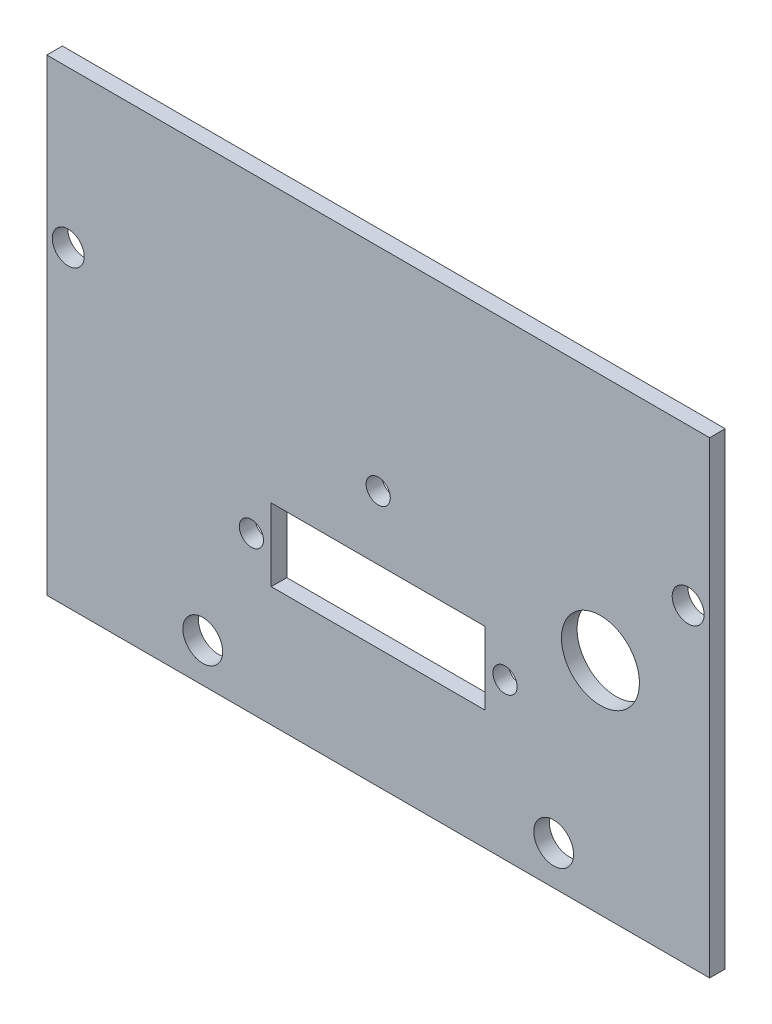
ISO-10303-21;
HEADER;
FILE_DESCRIPTION(('STEP AP214'),'2;1');
FILE_NAME('part.step','',(''),(''),'','','');
FILE_SCHEMA(('AUTOMOTIVE_DESIGN { 1 0 10303 214 1 1 1 1 }'));
ENDSEC;
DATA;
#1=APPLICATION_CONTEXT('core data for automotive mechanical design processes');
#2=APPLICATION_PROTOCOL_DEFINITION('international standard','automotive_design',2000,#1);
#3=PRODUCT_CONTEXT('',#1,'mechanical');
#4=PRODUCT('Part','Part','',(#3));
#5=PRODUCT_RELATED_PRODUCT_CATEGORY('part','',(#4));
#6=PRODUCT_DEFINITION_FORMATION('','',#4);
#7=PRODUCT_DEFINITION_CONTEXT('part definition',#1,'design');
#8=PRODUCT_DEFINITION('design','',#6,#7);
#9=PRODUCT_DEFINITION_SHAPE('','',#8);
#10=(LENGTH_UNIT() NAMED_UNIT(*) SI_UNIT(.MILLI.,.METRE.));
#11=(NAMED_UNIT(*) PLANE_ANGLE_UNIT() SI_UNIT($,.RADIAN.));
#12=(NAMED_UNIT(*) SI_UNIT($,.STERADIAN.) SOLID_ANGLE_UNIT());
#13=UNCERTAINTY_MEASURE_WITH_UNIT(LENGTH_MEASURE(1.E-05),#10,'distance_accuracy_value','');
#14=(GEOMETRIC_REPRESENTATION_CONTEXT(3) GLOBAL_UNCERTAINTY_ASSIGNED_CONTEXT((#13)) GLOBAL_UNIT_ASSIGNED_CONTEXT((#10,
#11,#12)) REPRESENTATION_CONTEXT('',''));
#15=CARTESIAN_POINT('',(0.,0.,0.));
#16=DIRECTION('',(0.,0.,1.));
#17=DIRECTION('',(1.,0.,0.));
#18=AXIS2_PLACEMENT_3D('',#15,#16,#17);
#19=CARTESIAN_POINT('',(-57.6928494941217,22.4995662721312,2.));
#20=DIRECTION('',(1.,0.,0.));
#21=DIRECTION('',(0.,1.,0.));
#22=AXIS2_PLACEMENT_3D('',#19,#20,#21);
#23=PLANE('',#22);
#24=DIRECTION('',(0.,-1.,0.));
#25=VECTOR('',#24,1.);
#26=CARTESIAN_POINT('',(-57.6928494941217,22.4995662721312,0.));
#27=LINE('',#26,#25);
#28=CARTESIAN_POINT('',(-57.6928494941217,22.4995662721312,0.));
#29=VERTEX_POINT('',#28);
#30=CARTESIAN_POINT('',(-57.6928494941217,-37.5004337278688,0.));
#31=VERTEX_POINT('',#30);
#32=EDGE_CURVE('E165',#29,#31,#27,.T.);
#33=ORIENTED_EDGE('',*,*,#32,.T.);
#34=DIRECTION('',(0.,0.,-1.));
#35=VECTOR('',#34,1.);
#36=CARTESIAN_POINT('',(-57.6928494941217,-37.5004337278688,2.));
#37=LINE('',#36,#35);
#38=CARTESIAN_POINT('',(-57.6928494941217,-37.5004337278688,2.));
#39=VERTEX_POINT('',#38);
#40=EDGE_CURVE('E11',#39,#31,#37,.T.);
#41=ORIENTED_EDGE('',*,*,#40,.F.);
#42=DIRECTION('',(0.,-1.,0.));
#43=VECTOR('',#42,1.);
#44=CARTESIAN_POINT('',(-57.6928494941217,22.4995662721312,2.));
#45=LINE('',#44,#43);
#46=CARTESIAN_POINT('',(-57.6928494941217,22.4995662721312,2.));
#47=VERTEX_POINT('',#46);
#48=EDGE_CURVE('E168',#47,#39,#45,.T.);
#49=ORIENTED_EDGE('',*,*,#48,.F.);
#50=DIRECTION('',(0.,0.,-1.));
#51=VECTOR('',#50,1.);
#52=CARTESIAN_POINT('',(-57.6928494941217,22.4995662721312,2.));
#53=LINE('',#52,#51);
#54=EDGE_CURVE('E178',#47,#29,#53,.T.);
#55=ORIENTED_EDGE('',*,*,#54,.T.);
#56=EDGE_LOOP('',(#33,#41,#49,#55));
#57=FACE_BOUND('',#56,.T.);
#58=ADVANCED_FACE('F33',(#57),#23,.F.);
#59=CARTESIAN_POINT('',(-57.6928494941217,-37.5004337278688,2.));
#60=DIRECTION('',(0.,1.,0.));
#61=DIRECTION('',(0.,0.,1.));
#62=AXIS2_PLACEMENT_3D('',#59,#60,#61);
#63=PLANE('',#62);
#64=DIRECTION('',(1.,0.,0.));
#65=VECTOR('',#64,1.);
#66=CARTESIAN_POINT('',(-57.6928494941217,-37.5004337278688,0.));
#67=LINE('',#66,#65);
#68=CARTESIAN_POINT('',(27.3071505058783,-37.5004337278688,0.));
#69=VERTEX_POINT('',#68);
#70=EDGE_CURVE('E181',#31,#69,#67,.T.);
#71=ORIENTED_EDGE('',*,*,#70,.T.);
#72=DIRECTION('',(0.,0.,-1.));
#73=VECTOR('',#72,1.);
#74=CARTESIAN_POINT('',(27.3071505058783,-37.5004337278688,2.));
#75=LINE('',#74,#73);
#76=CARTESIAN_POINT('',(27.3071505058783,-37.5004337278688,2.));
#77=VERTEX_POINT('',#76);
#78=EDGE_CURVE('E40',#77,#69,#75,.T.);
#79=ORIENTED_EDGE('',*,*,#78,.F.);
#80=DIRECTION('',(1.,0.,0.));
#81=VECTOR('',#80,1.);
#82=CARTESIAN_POINT('',(-57.6928494941217,-37.5004337278688,2.));
#83=LINE('',#82,#81);
#84=EDGE_CURVE('E171',#39,#77,#83,.T.);
#85=ORIENTED_EDGE('',*,*,#84,.F.);
#86=ORIENTED_EDGE('',*,*,#40,.T.);
#87=EDGE_LOOP('',(#71,#79,#85,#86));
#88=FACE_BOUND('',#87,.T.);
#89=ADVANCED_FACE('F210',(#88),#63,.F.);
#90=CARTESIAN_POINT('',(27.3071505058783,22.4995662721312,2.));
#91=DIRECTION('',(-1.,0.,0.));
#92=DIRECTION('',(0.,-1.,0.));
#93=AXIS2_PLACEMENT_3D('',#90,#91,#92);
#94=PLANE('',#93);
#95=DIRECTION('',(0.,1.,0.));
#96=VECTOR('',#95,1.);
#97=CARTESIAN_POINT('',(27.3071505058783,22.4995662721312,0.));
#98=LINE('',#97,#96);
#99=CARTESIAN_POINT('',(27.3071505058783,22.4995662721312,0.));
#100=VERTEX_POINT('',#99);
#101=EDGE_CURVE('E183',#69,#100,#98,.T.);
#102=ORIENTED_EDGE('',*,*,#101,.T.);
#103=DIRECTION('',(0.,0.,-1.));
#104=VECTOR('',#103,1.);
#105=CARTESIAN_POINT('',(27.3071505058783,22.4995662721312,2.));
#106=LINE('',#105,#104);
#107=CARTESIAN_POINT('',(27.3071505058783,22.4995662721312,2.));
#108=VERTEX_POINT('',#107);
#109=EDGE_CURVE('E188',#108,#100,#106,.T.);
#110=ORIENTED_EDGE('',*,*,#109,.F.);
#111=DIRECTION('',(0.,1.,0.));
#112=VECTOR('',#111,1.);
#113=CARTESIAN_POINT('',(27.3071505058783,22.4995662721312,2.));
#114=LINE('',#113,#112);
#115=EDGE_CURVE('E174',#77,#108,#114,.T.);
#116=ORIENTED_EDGE('',*,*,#115,.F.);
#117=ORIENTED_EDGE('',*,*,#78,.T.);
#118=EDGE_LOOP('',(#102,#110,#116,#117));
#119=FACE_BOUND('',#118,.T.);
#120=ADVANCED_FACE('F195',(#119),#94,.F.);
#121=CARTESIAN_POINT('',(-57.6928494941217,22.4995662721312,2.));
#122=DIRECTION('',(0.,-1.,0.));
#123=DIRECTION('',(0.,0.,-1.));
#124=AXIS2_PLACEMENT_3D('',#121,#122,#123);
#125=PLANE('',#124);
#126=DIRECTION('',(-1.,0.,0.));
#127=VECTOR('',#126,1.);
#128=CARTESIAN_POINT('',(-57.6928494941217,22.4995662721312,0.));
#129=LINE('',#128,#127);
#130=EDGE_CURVE('E172',#100,#29,#129,.T.);
#131=ORIENTED_EDGE('',*,*,#130,.T.);
#132=ORIENTED_EDGE('',*,*,#54,.F.);
#133=DIRECTION('',(-1.,0.,0.));
#134=VECTOR('',#133,1.);
#135=CARTESIAN_POINT('',(-57.6928494941217,22.4995662721312,2.));
#136=LINE('',#135,#134);
#137=EDGE_CURVE('E176',#108,#47,#136,.T.);
#138=ORIENTED_EDGE('',*,*,#137,.F.);
#139=ORIENTED_EDGE('',*,*,#109,.T.);
#140=EDGE_LOOP('',(#131,#132,#138,#139));
#141=FACE_BOUND('',#140,.T.);
#142=ADVANCED_FACE('F204',(#141),#125,.F.);
#143=CARTESIAN_POINT('',(0.,0.,2.));
#144=DIRECTION('',(0.,0.,1.));
#145=DIRECTION('',(1.,0.,0.));
#146=AXIS2_PLACEMENT_3D('',#143,#144,#145);
#147=PLANE('',#146);
#148=CARTESIAN_POINT('',(24.5571505058783,2.49956627213123,2.));
#149=DIRECTION('',(0.,0.,1.));
#150=DIRECTION('',(1.,0.,0.));
#151=AXIS2_PLACEMENT_3D('',#148,#149,#150);
#152=CIRCLE('',#151,2.05);
#153=CARTESIAN_POINT('',(26.6071505058783,2.49956627213123,2.));
#154=VERTEX_POINT('',#153);
#155=EDGE_CURVE('E274',#154,#154,#152,.T.);
#156=ORIENTED_EDGE('',*,*,#155,.F.);
#157=EDGE_LOOP('',(#156));
#158=FACE_BOUND('',#157,.T.);
#159=CARTESIAN_POINT('',(-54.9428494941217,2.49956627213123,2.));
#160=DIRECTION('',(0.,0.,1.));
#161=DIRECTION('',(1.,0.,0.));
#162=AXIS2_PLACEMENT_3D('',#159,#160,#161);
#163=CIRCLE('',#162,2.05);
#164=CARTESIAN_POINT('',(-52.8928494941217,2.49956627213123,2.));
#165=VERTEX_POINT('',#164);
#166=EDGE_CURVE('E278',#165,#165,#163,.T.);
#167=ORIENTED_EDGE('',*,*,#166,.F.);
#168=EDGE_LOOP('',(#167));
#169=FACE_BOUND('',#168,.T.);
#170=DIRECTION('',(0.,-1.,0.));
#171=VECTOR('',#170,1.);
#172=CARTESIAN_POINT('',(-1.47284949412169,-12.8504337278688,2.));
#173=LINE('',#172,#171);
#174=CARTESIAN_POINT('',(-1.47284949412169,-12.8504337278688,2.));
#175=VERTEX_POINT('',#174);
#176=CARTESIAN_POINT('',(-1.47284949412169,-22.1504337278688,2.));
#177=VERTEX_POINT('',#176);
#178=EDGE_CURVE('E107',#175,#177,#173,.T.);
#179=ORIENTED_EDGE('',*,*,#178,.T.);
#180=DIRECTION('',(-1.,0.,0.));
#181=VECTOR('',#180,1.);
#182=CARTESIAN_POINT('',(-1.47284949412169,-22.1504337278688,2.));
#183=LINE('',#182,#181);
#184=CARTESIAN_POINT('',(-28.9128494941217,-22.1504337278688,2.));
#185=VERTEX_POINT('',#184);
#186=EDGE_CURVE('E96',#177,#185,#183,.T.);
#187=ORIENTED_EDGE('',*,*,#186,.T.);
#188=DIRECTION('',(0.,1.,0.));
#189=VECTOR('',#188,1.);
#190=CARTESIAN_POINT('',(-28.9128494941217,-12.8504337278688,2.));
#191=LINE('',#190,#189);
#192=CARTESIAN_POINT('',(-28.9128494941217,-12.8504337278688,2.));
#193=VERTEX_POINT('',#192);
#194=EDGE_CURVE('E118',#185,#193,#191,.T.);
#195=ORIENTED_EDGE('',*,*,#194,.T.);
#196=DIRECTION('',(1.,0.,0.));
#197=VECTOR('',#196,1.);
#198=CARTESIAN_POINT('',(-1.47284949412169,-12.8504337278688,2.));
#199=LINE('',#198,#197);
#200=EDGE_CURVE('E114',#193,#175,#199,.T.);
#201=ORIENTED_EDGE('',*,*,#200,.T.);
#202=EDGE_LOOP('',(#179,#187,#195,#201));
#203=FACE_BOUND('',#202,.T.);
#204=CARTESIAN_POINT('',(-31.4528494941217,-17.5004337278688,2.));
#205=DIRECTION('',(0.,0.,1.));
#206=DIRECTION('',(1.,0.,0.));
#207=AXIS2_PLACEMENT_3D('',#204,#205,#206);
#208=CIRCLE('',#207,1.55);
#209=CARTESIAN_POINT('',(-29.9028494941217,-17.5004337278688,2.));
#210=VERTEX_POINT('',#209);
#211=EDGE_CURVE('E103',#210,#210,#208,.F.);
#212=ORIENTED_EDGE('',*,*,#211,.T.);
#213=EDGE_LOOP('',(#212));
#214=FACE_BOUND('',#213,.T.);
#215=CARTESIAN_POINT('',(1.06715050587831,-17.5004337278688,2.));
#216=DIRECTION('',(0.,0.,1.));
#217=DIRECTION('',(1.,0.,0.));
#218=AXIS2_PLACEMENT_3D('',#215,#216,#217);
#219=CIRCLE('',#218,1.55);
#220=CARTESIAN_POINT('',(2.61715050587831,-17.5004337278688,2.));
#221=VERTEX_POINT('',#220);
#222=EDGE_CURVE('E135',#221,#221,#219,.F.);
#223=ORIENTED_EDGE('',*,*,#222,.T.);
#224=EDGE_LOOP('',(#223));
#225=FACE_BOUND('',#224,.T.);
#226=CARTESIAN_POINT('',(-15.1928494941217,-4.67043372786877,2.));
#227=DIRECTION('',(0.,0.,1.));
#228=DIRECTION('',(1.,0.,0.));
#229=AXIS2_PLACEMENT_3D('',#226,#227,#228);
#230=CIRCLE('',#229,1.55);
#231=CARTESIAN_POINT('',(-13.6428494941217,-4.67043372786877,2.));
#232=VERTEX_POINT('',#231);
#233=EDGE_CURVE('E141',#232,#232,#230,.F.);
#234=ORIENTED_EDGE('',*,*,#233,.T.);
#235=EDGE_LOOP('',(#234));
#236=FACE_BOUND('',#235,.T.);
#237=CARTESIAN_POINT('',(13.3071505058783,-9.24043372786876,2.));
#238=DIRECTION('',(0.,0.,1.));
#239=DIRECTION('',(1.,0.,0.));
#240=AXIS2_PLACEMENT_3D('',#237,#238,#239);
#241=CIRCLE('',#240,5.);
#242=CARTESIAN_POINT('',(18.3071505058783,-9.24043372786876,2.));
#243=VERTEX_POINT('',#242);
#244=EDGE_CURVE('E147',#243,#243,#241,.F.);
#245=ORIENTED_EDGE('',*,*,#244,.T.);
#246=EDGE_LOOP('',(#245));
#247=FACE_BOUND('',#246,.T.);
#248=CARTESIAN_POINT('',(-37.6928494941217,-32.5004337278688,2.));
#249=DIRECTION('',(0.,0.,1.));
#250=DIRECTION('',(1.,0.,0.));
#251=AXIS2_PLACEMENT_3D('',#248,#249,#250);
#252=CIRCLE('',#251,2.55);
#253=CARTESIAN_POINT('',(-35.1428494941217,-32.5004337278688,2.));
#254=VERTEX_POINT('',#253);
#255=EDGE_CURVE('E153',#254,#254,#252,.F.);
#256=ORIENTED_EDGE('',*,*,#255,.T.);
#257=EDGE_LOOP('',(#256));
#258=FACE_BOUND('',#257,.T.);
#259=CARTESIAN_POINT('',(7.30715050587833,-32.5004337278688,2.));
#260=DIRECTION('',(0.,0.,1.));
#261=DIRECTION('',(1.,0.,0.));
#262=AXIS2_PLACEMENT_3D('',#259,#260,#261);
#263=CIRCLE('',#262,2.55);
#264=CARTESIAN_POINT('',(9.85715050587833,-32.5004337278688,2.));
#265=VERTEX_POINT('',#264);
#266=EDGE_CURVE('E159',#265,#265,#263,.F.);
#267=ORIENTED_EDGE('',*,*,#266,.T.);
#268=EDGE_LOOP('',(#267));
#269=FACE_BOUND('',#268,.T.);
#270=ORIENTED_EDGE('',*,*,#48,.T.);
#271=ORIENTED_EDGE('',*,*,#84,.T.);
#272=ORIENTED_EDGE('',*,*,#115,.T.);
#273=ORIENTED_EDGE('',*,*,#137,.T.);
#274=EDGE_LOOP('',(#270,#271,#272,#273));
#275=FACE_BOUND('',#274,.T.);
#276=ADVANCED_FACE('F112',(#158,#169,#203,#214,#225,#236,#247,#258,#269,#275),#147,.T.);
#277=CARTESIAN_POINT('',(0.,0.,0.));
#278=DIRECTION('',(0.,0.,1.));
#279=DIRECTION('',(1.,0.,0.));
#280=AXIS2_PLACEMENT_3D('',#277,#278,#279);
#281=PLANE('',#280);
#282=CARTESIAN_POINT('',(24.5571505058783,2.49956627213123,0.));
#283=DIRECTION('',(0.,0.,1.));
#284=DIRECTION('',(1.,0.,0.));
#285=AXIS2_PLACEMENT_3D('',#282,#283,#284);
#286=CIRCLE('',#285,2.05);
#287=CARTESIAN_POINT('',(26.6071505058783,2.49956627213123,0.));
#288=VERTEX_POINT('',#287);
#289=EDGE_CURVE('E277',#288,#288,#286,.F.);
#290=ORIENTED_EDGE('',*,*,#289,.F.);
#291=EDGE_LOOP('',(#290));
#292=FACE_BOUND('',#291,.T.);
#293=CARTESIAN_POINT('',(-54.9428494941217,2.49956627213123,0.));
#294=DIRECTION('',(0.,0.,1.));
#295=DIRECTION('',(1.,0.,0.));
#296=AXIS2_PLACEMENT_3D('',#293,#294,#295);
#297=CIRCLE('',#296,2.05);
#298=CARTESIAN_POINT('',(-52.8928494941217,2.49956627213123,0.));
#299=VERTEX_POINT('',#298);
#300=EDGE_CURVE('E281',#299,#299,#297,.F.);
#301=ORIENTED_EDGE('',*,*,#300,.F.);
#302=EDGE_LOOP('',(#301));
#303=FACE_BOUND('',#302,.T.);
#304=DIRECTION('',(-1.,0.,0.));
#305=VECTOR('',#304,1.);
#306=CARTESIAN_POINT('',(-1.47284949412169,-22.1504337278688,0.));
#307=LINE('',#306,#305);
#308=CARTESIAN_POINT('',(-1.47284949412169,-22.1504337278688,0.));
#309=VERTEX_POINT('',#308);
#310=CARTESIAN_POINT('',(-28.9128494941217,-22.1504337278688,0.));
#311=VERTEX_POINT('',#310);
#312=EDGE_CURVE('E116',#309,#311,#307,.T.);
#313=ORIENTED_EDGE('',*,*,#312,.F.);
#314=DIRECTION('',(0.,-1.,0.));
#315=VECTOR('',#314,1.);
#316=CARTESIAN_POINT('',(-1.47284949412169,-12.8504337278688,0.));
#317=LINE('',#316,#315);
#318=CARTESIAN_POINT('',(-1.47284949412169,-12.8504337278688,0.));
#319=VERTEX_POINT('',#318);
#320=EDGE_CURVE('E55',#319,#309,#317,.T.);
#321=ORIENTED_EDGE('',*,*,#320,.F.);
#322=DIRECTION('',(1.,0.,0.));
#323=VECTOR('',#322,1.);
#324=CARTESIAN_POINT('',(-1.47284949412169,-12.8504337278688,0.));
#325=LINE('',#324,#323);
#326=CARTESIAN_POINT('',(-28.9128494941217,-12.8504337278688,0.));
#327=VERTEX_POINT('',#326);
#328=EDGE_CURVE('E109',#327,#319,#325,.T.);
#329=ORIENTED_EDGE('',*,*,#328,.F.);
#330=DIRECTION('',(0.,1.,0.));
#331=VECTOR('',#330,1.);
#332=CARTESIAN_POINT('',(-28.9128494941217,-12.8504337278688,0.));
#333=LINE('',#332,#331);
#334=EDGE_CURVE('E123',#311,#327,#333,.T.);
#335=ORIENTED_EDGE('',*,*,#334,.F.);
#336=EDGE_LOOP('',(#313,#321,#329,#335));
#337=FACE_BOUND('',#336,.T.);
#338=CARTESIAN_POINT('',(-31.4528494941217,-17.5004337278688,0.));
#339=DIRECTION('',(0.,0.,-1.));
#340=DIRECTION('',(-1.,0.,0.));
#341=AXIS2_PLACEMENT_3D('',#338,#339,#340);
#342=CIRCLE('',#341,1.55);
#343=CARTESIAN_POINT('',(-33.0028494941217,-17.5004337278688,0.));
#344=VERTEX_POINT('',#343);
#345=EDGE_CURVE('E132',#344,#344,#342,.T.);
#346=ORIENTED_EDGE('',*,*,#345,.F.);
#347=EDGE_LOOP('',(#346));
#348=FACE_BOUND('',#347,.T.);
#349=CARTESIAN_POINT('',(1.06715050587831,-17.5004337278688,0.));
#350=DIRECTION('',(0.,0.,-1.));
#351=DIRECTION('',(-1.,0.,0.));
#352=AXIS2_PLACEMENT_3D('',#349,#350,#351);
#353=CIRCLE('',#352,1.55);
#354=CARTESIAN_POINT('',(-0.482849494121686,-17.5004337278688,0.));
#355=VERTEX_POINT('',#354);
#356=EDGE_CURVE('E138',#355,#355,#353,.T.);
#357=ORIENTED_EDGE('',*,*,#356,.F.);
#358=EDGE_LOOP('',(#357));
#359=FACE_BOUND('',#358,.T.);
#360=CARTESIAN_POINT('',(-15.1928494941217,-4.67043372786877,0.));
#361=DIRECTION('',(0.,0.,-1.));
#362=DIRECTION('',(-1.,0.,0.));
#363=AXIS2_PLACEMENT_3D('',#360,#361,#362);
#364=CIRCLE('',#363,1.55);
#365=CARTESIAN_POINT('',(-16.7428494941217,-4.67043372786877,0.));
#366=VERTEX_POINT('',#365);
#367=EDGE_CURVE('E144',#366,#366,#364,.T.);
#368=ORIENTED_EDGE('',*,*,#367,.F.);
#369=EDGE_LOOP('',(#368));
#370=FACE_BOUND('',#369,.T.);
#371=CARTESIAN_POINT('',(13.3071505058783,-9.24043372786876,0.));
#372=DIRECTION('',(0.,0.,-1.));
#373=DIRECTION('',(-1.,0.,0.));
#374=AXIS2_PLACEMENT_3D('',#371,#372,#373);
#375=CIRCLE('',#374,5.);
#376=CARTESIAN_POINT('',(8.30715050587831,-9.24043372786876,0.));
#377=VERTEX_POINT('',#376);
#378=EDGE_CURVE('E150',#377,#377,#375,.T.);
#379=ORIENTED_EDGE('',*,*,#378,.F.);
#380=EDGE_LOOP('',(#379));
#381=FACE_BOUND('',#380,.T.);
#382=CARTESIAN_POINT('',(-37.6928494941217,-32.5004337278688,0.));
#383=DIRECTION('',(0.,0.,-1.));
#384=DIRECTION('',(-1.,0.,0.));
#385=AXIS2_PLACEMENT_3D('',#382,#383,#384);
#386=CIRCLE('',#385,2.55);
#387=CARTESIAN_POINT('',(-40.2428494941217,-32.5004337278688,0.));
#388=VERTEX_POINT('',#387);
#389=EDGE_CURVE('E156',#388,#388,#386,.T.);
#390=ORIENTED_EDGE('',*,*,#389,.F.);
#391=EDGE_LOOP('',(#390));
#392=FACE_BOUND('',#391,.T.);
#393=CARTESIAN_POINT('',(7.30715050587833,-32.5004337278688,0.));
#394=DIRECTION('',(0.,0.,-1.));
#395=DIRECTION('',(-1.,0.,0.));
#396=AXIS2_PLACEMENT_3D('',#393,#394,#395);
#397=CIRCLE('',#396,2.55);
#398=CARTESIAN_POINT('',(4.75715050587833,-32.5004337278688,0.));
#399=VERTEX_POINT('',#398);
#400=EDGE_CURVE('E162',#399,#399,#397,.T.);
#401=ORIENTED_EDGE('',*,*,#400,.F.);
#402=EDGE_LOOP('',(#401));
#403=FACE_BOUND('',#402,.T.);
#404=ORIENTED_EDGE('',*,*,#32,.F.);
#405=ORIENTED_EDGE('',*,*,#130,.F.);
#406=ORIENTED_EDGE('',*,*,#101,.F.);
#407=ORIENTED_EDGE('',*,*,#70,.F.);
#408=EDGE_LOOP('',(#404,#405,#406,#407));
#409=FACE_BOUND('',#408,.T.);
#410=ADVANCED_FACE('F201',(#292,#303,#337,#348,#359,#370,#381,#392,#403,#409),#281,.F.);
#411=CARTESIAN_POINT('',(7.30715050587833,-32.5004337278688,2.001));
#412=DIRECTION('',(0.,0.,-1.));
#413=DIRECTION('',(-1.,0.,0.));
#414=AXIS2_PLACEMENT_3D('',#411,#412,#413);
#415=CYLINDRICAL_SURFACE('',#414,2.55);
#416=ORIENTED_EDGE('',*,*,#266,.F.);
#417=EDGE_LOOP('',(#416));
#418=FACE_BOUND('',#417,.T.);
#419=ORIENTED_EDGE('',*,*,#400,.T.);
#420=EDGE_LOOP('',(#419));
#421=FACE_BOUND('',#420,.T.);
#422=ADVANCED_FACE('F222',(#418,#421),#415,.F.);
#423=CARTESIAN_POINT('',(-37.6928494941217,-32.5004337278688,2.001));
#424=DIRECTION('',(0.,0.,-1.));
#425=DIRECTION('',(-1.,0.,0.));
#426=AXIS2_PLACEMENT_3D('',#423,#424,#425);
#427=CYLINDRICAL_SURFACE('',#426,2.55);
#428=ORIENTED_EDGE('',*,*,#255,.F.);
#429=EDGE_LOOP('',(#428));
#430=FACE_BOUND('',#429,.T.);
#431=ORIENTED_EDGE('',*,*,#389,.T.);
#432=EDGE_LOOP('',(#431));
#433=FACE_BOUND('',#432,.T.);
#434=ADVANCED_FACE('F229',(#430,#433),#427,.F.);
#435=CARTESIAN_POINT('',(13.3071505058783,-9.24043372786876,2.001));
#436=DIRECTION('',(0.,0.,-1.));
#437=DIRECTION('',(-1.,0.,0.));
#438=AXIS2_PLACEMENT_3D('',#435,#436,#437);
#439=CYLINDRICAL_SURFACE('',#438,5.);
#440=ORIENTED_EDGE('',*,*,#244,.F.);
#441=EDGE_LOOP('',(#440));
#442=FACE_BOUND('',#441,.T.);
#443=ORIENTED_EDGE('',*,*,#378,.T.);
#444=EDGE_LOOP('',(#443));
#445=FACE_BOUND('',#444,.T.);
#446=ADVANCED_FACE('F233',(#442,#445),#439,.F.);
#447=CARTESIAN_POINT('',(-15.1928494941217,-4.67043372786877,2.001));
#448=DIRECTION('',(0.,0.,-1.));
#449=DIRECTION('',(-1.,0.,0.));
#450=AXIS2_PLACEMENT_3D('',#447,#448,#449);
#451=CYLINDRICAL_SURFACE('',#450,1.55);
#452=ORIENTED_EDGE('',*,*,#233,.F.);
#453=EDGE_LOOP('',(#452));
#454=FACE_BOUND('',#453,.T.);
#455=ORIENTED_EDGE('',*,*,#367,.T.);
#456=EDGE_LOOP('',(#455));
#457=FACE_BOUND('',#456,.T.);
#458=ADVANCED_FACE('F237',(#454,#457),#451,.F.);
#459=CARTESIAN_POINT('',(1.06715050587831,-17.5004337278688,2.001));
#460=DIRECTION('',(0.,0.,-1.));
#461=DIRECTION('',(-1.,0.,0.));
#462=AXIS2_PLACEMENT_3D('',#459,#460,#461);
#463=CYLINDRICAL_SURFACE('',#462,1.55);
#464=ORIENTED_EDGE('',*,*,#222,.F.);
#465=EDGE_LOOP('',(#464));
#466=FACE_BOUND('',#465,.T.);
#467=ORIENTED_EDGE('',*,*,#356,.T.);
#468=EDGE_LOOP('',(#467));
#469=FACE_BOUND('',#468,.T.);
#470=ADVANCED_FACE('F241',(#466,#469),#463,.F.);
#471=CARTESIAN_POINT('',(-31.4528494941217,-17.5004337278688,2.001));
#472=DIRECTION('',(0.,0.,-1.));
#473=DIRECTION('',(-1.,0.,0.));
#474=AXIS2_PLACEMENT_3D('',#471,#472,#473);
#475=CYLINDRICAL_SURFACE('',#474,1.55);
#476=ORIENTED_EDGE('',*,*,#211,.F.);
#477=EDGE_LOOP('',(#476));
#478=FACE_BOUND('',#477,.T.);
#479=ORIENTED_EDGE('',*,*,#345,.T.);
#480=EDGE_LOOP('',(#479));
#481=FACE_BOUND('',#480,.T.);
#482=ADVANCED_FACE('F245',(#478,#481),#475,.F.);
#483=CARTESIAN_POINT('',(-1.47284949412169,-12.8504337278688,2.001));
#484=DIRECTION('',(1.,0.,0.));
#485=DIRECTION('',(0.,1.,0.));
#486=AXIS2_PLACEMENT_3D('',#483,#484,#485);
#487=PLANE('',#486);
#488=DIRECTION('',(0.,0.,-1.));
#489=VECTOR('',#488,1.);
#490=CARTESIAN_POINT('',(-1.47284949412169,-12.8504337278688,2.001));
#491=LINE('',#490,#489);
#492=EDGE_CURVE('E104',#175,#319,#491,.T.);
#493=ORIENTED_EDGE('',*,*,#492,.T.);
#494=ORIENTED_EDGE('',*,*,#320,.T.);
#495=DIRECTION('',(0.,0.,-1.));
#496=VECTOR('',#495,1.);
#497=CARTESIAN_POINT('',(-1.47284949412169,-22.1504337278688,2.001));
#498=LINE('',#497,#496);
#499=EDGE_CURVE('E98',#177,#309,#498,.T.);
#500=ORIENTED_EDGE('',*,*,#499,.F.);
#501=ORIENTED_EDGE('',*,*,#178,.F.);
#502=EDGE_LOOP('',(#493,#494,#500,#501));
#503=FACE_BOUND('',#502,.T.);
#504=ADVANCED_FACE('F106',(#503),#487,.F.);
#505=CARTESIAN_POINT('',(-1.47284949412169,-12.8504337278688,2.001));
#506=DIRECTION('',(0.,1.,0.));
#507=DIRECTION('',(0.,0.,1.));
#508=AXIS2_PLACEMENT_3D('',#505,#506,#507);
#509=PLANE('',#508);
#510=DIRECTION('',(0.,0.,-1.));
#511=VECTOR('',#510,1.);
#512=CARTESIAN_POINT('',(-28.9128494941217,-12.8504337278688,2.001));
#513=LINE('',#512,#511);
#514=EDGE_CURVE('E129',#193,#327,#513,.T.);
#515=ORIENTED_EDGE('',*,*,#514,.T.);
#516=ORIENTED_EDGE('',*,*,#328,.T.);
#517=ORIENTED_EDGE('',*,*,#492,.F.);
#518=ORIENTED_EDGE('',*,*,#200,.F.);
#519=EDGE_LOOP('',(#515,#516,#517,#518));
#520=FACE_BOUND('',#519,.T.);
#521=ADVANCED_FACE('F252',(#520),#509,.F.);
#522=CARTESIAN_POINT('',(-28.9128494941217,-12.8504337278688,2.001));
#523=DIRECTION('',(-1.,0.,0.));
#524=DIRECTION('',(0.,0.,1.));
#525=AXIS2_PLACEMENT_3D('',#522,#523,#524);
#526=PLANE('',#525);
#527=DIRECTION('',(0.,0.,-1.));
#528=VECTOR('',#527,1.);
#529=CARTESIAN_POINT('',(-28.9128494941217,-22.1504337278688,2.001));
#530=LINE('',#529,#528);
#531=EDGE_CURVE('E47',#185,#311,#530,.T.);
#532=ORIENTED_EDGE('',*,*,#531,.T.);
#533=ORIENTED_EDGE('',*,*,#334,.T.);
#534=ORIENTED_EDGE('',*,*,#514,.F.);
#535=ORIENTED_EDGE('',*,*,#194,.F.);
#536=EDGE_LOOP('',(#532,#533,#534,#535));
#537=FACE_BOUND('',#536,.T.);
#538=ADVANCED_FACE('F256',(#537),#526,.F.);
#539=CARTESIAN_POINT('',(-1.47284949412169,-22.1504337278688,2.001));
#540=DIRECTION('',(0.,-1.,0.));
#541=DIRECTION('',(0.,0.,-1.));
#542=AXIS2_PLACEMENT_3D('',#539,#540,#541);
#543=PLANE('',#542);
#544=ORIENTED_EDGE('',*,*,#499,.T.);
#545=ORIENTED_EDGE('',*,*,#312,.T.);
#546=ORIENTED_EDGE('',*,*,#531,.F.);
#547=ORIENTED_EDGE('',*,*,#186,.F.);
#548=EDGE_LOOP('',(#544,#545,#546,#547));
#549=FACE_BOUND('',#548,.T.);
#550=ADVANCED_FACE('F97',(#549),#543,.F.);
#551=CARTESIAN_POINT('',(-54.9428494941217,2.49956627213123,-0.00100000000000013));
#552=DIRECTION('',(0.,0.,1.));
#553=DIRECTION('',(1.,0.,0.));
#554=AXIS2_PLACEMENT_3D('',#551,#552,#553);
#555=CYLINDRICAL_SURFACE('',#554,2.05);
#556=ORIENTED_EDGE('',*,*,#166,.T.);
#557=EDGE_LOOP('',(#556));
#558=FACE_BOUND('',#557,.T.);
#559=ORIENTED_EDGE('',*,*,#300,.T.);
#560=EDGE_LOOP('',(#559));
#561=FACE_BOUND('',#560,.T.);
#562=ADVANCED_FACE('F255',(#558,#561),#555,.F.);
#563=CARTESIAN_POINT('',(24.5571505058783,2.49956627213123,-0.00100000000000013));
#564=DIRECTION('',(0.,0.,1.));
#565=DIRECTION('',(1.,0.,0.));
#566=AXIS2_PLACEMENT_3D('',#563,#564,#565);
#567=CYLINDRICAL_SURFACE('',#566,2.05);
#568=ORIENTED_EDGE('',*,*,#155,.T.);
#569=EDGE_LOOP('',(#568));
#570=FACE_BOUND('',#569,.T.);
#571=ORIENTED_EDGE('',*,*,#289,.T.);
#572=EDGE_LOOP('',(#571));
#573=FACE_BOUND('',#572,.T.);
#574=ADVANCED_FACE('F265',(#570,#573),#567,.F.);
#575=CLOSED_SHELL('',(#58,#89,#120,#142,#276,#410,#422,#434,#446,#458,#470,#482,#504,#521,#538,
#550,#562,#574));
#576=MANIFOLD_SOLID_BREP('B2',#575);
#577=ADVANCED_BREP_SHAPE_REPRESENTATION('',(#18,#576),#14);
#578=SHAPE_DEFINITION_REPRESENTATION(#9,#577);
ENDSEC;
END-ISO-10303-21;
